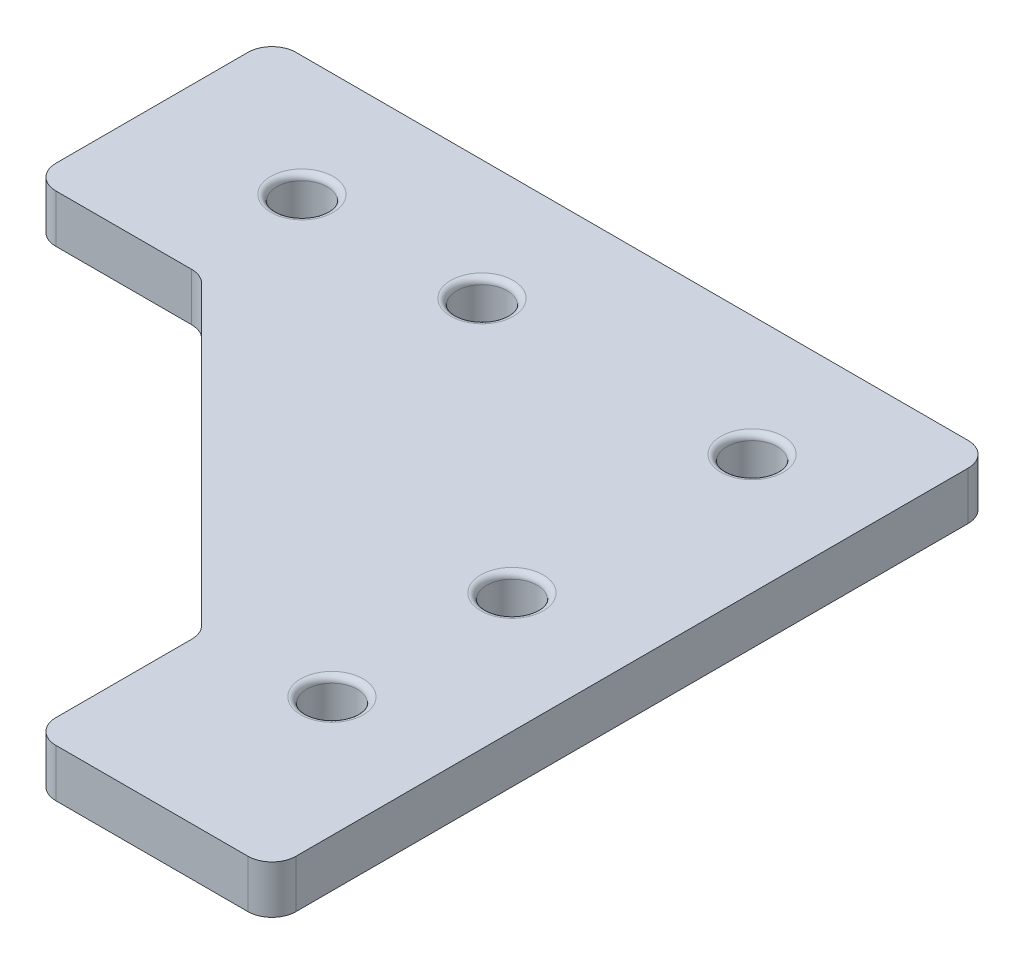
ISO-10303-21;
HEADER;
FILE_DESCRIPTION(('STEP AP214'),'2;1');
FILE_NAME('part.step','',(''),(''),'','','');
FILE_SCHEMA(('AUTOMOTIVE_DESIGN { 1 0 10303 214 1 1 1 1 }'));
ENDSEC;
DATA;
#1=APPLICATION_CONTEXT('core data for automotive mechanical design processes');
#2=APPLICATION_PROTOCOL_DEFINITION('international standard','automotive_design',2000,#1);
#3=PRODUCT_CONTEXT('',#1,'mechanical');
#4=PRODUCT('Part','Part','',(#3));
#5=PRODUCT_RELATED_PRODUCT_CATEGORY('part','',(#4));
#6=PRODUCT_DEFINITION_FORMATION('','',#4);
#7=PRODUCT_DEFINITION_CONTEXT('part definition',#1,'design');
#8=PRODUCT_DEFINITION('design','',#6,#7);
#9=PRODUCT_DEFINITION_SHAPE('','',#8);
#10=(LENGTH_UNIT() NAMED_UNIT(*) SI_UNIT(.MILLI.,.METRE.));
#11=(NAMED_UNIT(*) PLANE_ANGLE_UNIT() SI_UNIT($,.RADIAN.));
#12=(NAMED_UNIT(*) SI_UNIT($,.STERADIAN.) SOLID_ANGLE_UNIT());
#13=UNCERTAINTY_MEASURE_WITH_UNIT(LENGTH_MEASURE(1.E-05),#10,'distance_accuracy_value','');
#14=(GEOMETRIC_REPRESENTATION_CONTEXT(3) GLOBAL_UNCERTAINTY_ASSIGNED_CONTEXT((#13)) GLOBAL_UNIT_ASSIGNED_CONTEXT((#10,
#11,#12)) REPRESENTATION_CONTEXT('',''));
#15=CARTESIAN_POINT('',(0.,0.,0.));
#16=DIRECTION('',(0.,0.,1.));
#17=DIRECTION('',(1.,0.,0.));
#18=AXIS2_PLACEMENT_3D('',#15,#16,#17);
#19=CARTESIAN_POINT('',(410.,-56.,0.));
#20=DIRECTION('',(-1.,0.,0.));
#21=DIRECTION('',(0.,0.,1.));
#22=AXIS2_PLACEMENT_3D('',#19,#20,#21);
#23=PLANE('',#22);
#24=DIRECTION('',(0.,0.,-1.));
#25=VECTOR('',#24,1.);
#26=CARTESIAN_POINT('',(410.,-56.,0.));
#27=LINE('',#26,#25);
#28=CARTESIAN_POINT('',(410.,-56.,1788.));
#29=VERTEX_POINT('',#28);
#30=CARTESIAN_POINT('',(410.,-56.,1732.));
#31=VERTEX_POINT('',#30);
#32=EDGE_CURVE('E164',#29,#31,#27,.T.);
#33=ORIENTED_EDGE('',*,*,#32,.F.);
#34=DIRECTION('',(0.,-1.,0.));
#35=VECTOR('',#34,1.);
#36=CARTESIAN_POINT('',(410.,-56.,1788.));
#37=LINE('',#36,#35);
#38=CARTESIAN_POINT('',(410.,-60.,1788.));
#39=VERTEX_POINT('',#38);
#40=EDGE_CURVE('E148',#29,#39,#37,.T.);
#41=ORIENTED_EDGE('',*,*,#40,.T.);
#42=DIRECTION('',(0.,0.,-1.));
#43=VECTOR('',#42,1.);
#44=CARTESIAN_POINT('',(410.,-60.,0.));
#45=LINE('',#44,#43);
#46=CARTESIAN_POINT('',(410.,-60.,1732.));
#47=VERTEX_POINT('',#46);
#48=EDGE_CURVE('E161',#39,#47,#45,.T.);
#49=ORIENTED_EDGE('',*,*,#48,.T.);
#50=DIRECTION('',(0.,-1.,0.));
#51=VECTOR('',#50,1.);
#52=CARTESIAN_POINT('',(410.,-56.,1732.));
#53=LINE('',#52,#51);
#54=EDGE_CURVE('E167',#47,#31,#53,.F.);
#55=ORIENTED_EDGE('',*,*,#54,.T.);
#56=EDGE_LOOP('',(#33,#41,#49,#55));
#57=FACE_BOUND('',#56,.T.);
#58=ADVANCED_FACE('F40',(#57),#23,.F.);
#59=CARTESIAN_POINT('',(0.,-56.,1730.));
#60=DIRECTION('',(0.,0.,1.));
#61=DIRECTION('',(1.,0.,0.));
#62=AXIS2_PLACEMENT_3D('',#59,#60,#61);
#63=PLANE('',#62);
#64=DIRECTION('',(-1.,0.,0.));
#65=VECTOR('',#64,1.);
#66=CARTESIAN_POINT('',(0.,-60.,1730.));
#67=LINE('',#66,#65);
#68=CARTESIAN_POINT('',(408.,-60.,1730.));
#69=VERTEX_POINT('',#68);
#70=CARTESIAN_POINT('',(352.,-60.,1730.));
#71=VERTEX_POINT('',#70);
#72=EDGE_CURVE('E172',#69,#71,#67,.T.);
#73=ORIENTED_EDGE('',*,*,#72,.T.);
#74=DIRECTION('',(0.,-1.,0.));
#75=VECTOR('',#74,1.);
#76=CARTESIAN_POINT('',(352.,-56.,1730.));
#77=LINE('',#76,#75);
#78=CARTESIAN_POINT('',(352.,-56.,1730.));
#79=VERTEX_POINT('',#78);
#80=EDGE_CURVE('E262',#71,#79,#77,.F.);
#81=ORIENTED_EDGE('',*,*,#80,.T.);
#82=DIRECTION('',(-1.,0.,0.));
#83=VECTOR('',#82,1.);
#84=CARTESIAN_POINT('',(0.,-56.,1730.));
#85=LINE('',#84,#83);
#86=CARTESIAN_POINT('',(408.,-56.,1730.));
#87=VERTEX_POINT('',#86);
#88=EDGE_CURVE('E503',#87,#79,#85,.T.);
#89=ORIENTED_EDGE('',*,*,#88,.F.);
#90=DIRECTION('',(0.,-1.,0.));
#91=VECTOR('',#90,1.);
#92=CARTESIAN_POINT('',(408.,-56.,1730.));
#93=LINE('',#92,#91);
#94=EDGE_CURVE('E258',#87,#69,#93,.T.);
#95=ORIENTED_EDGE('',*,*,#94,.T.);
#96=EDGE_LOOP('',(#73,#81,#89,#95));
#97=FACE_BOUND('',#96,.T.);
#98=ADVANCED_FACE('F363',(#97),#63,.F.);
#99=CARTESIAN_POINT('',(350.,-56.,0.));
#100=DIRECTION('',(1.,0.,0.));
#101=DIRECTION('',(0.,0.,-1.));
#102=AXIS2_PLACEMENT_3D('',#99,#100,#101);
#103=PLANE('',#102);
#104=DIRECTION('',(0.,0.,1.));
#105=VECTOR('',#104,1.);
#106=CARTESIAN_POINT('',(350.,-60.,0.));
#107=LINE('',#106,#105);
#108=CARTESIAN_POINT('',(350.,-60.,1732.));
#109=VERTEX_POINT('',#108);
#110=CARTESIAN_POINT('',(350.,-60.,1748.));
#111=VERTEX_POINT('',#110);
#112=EDGE_CURVE('E176',#109,#111,#107,.T.);
#113=ORIENTED_EDGE('',*,*,#112,.T.);
#114=DIRECTION('',(0.,-1.,0.));
#115=VECTOR('',#114,1.);
#116=CARTESIAN_POINT('',(350.,-56.,1748.));
#117=LINE('',#116,#115);
#118=CARTESIAN_POINT('',(350.,-56.,1748.));
#119=VERTEX_POINT('',#118);
#120=EDGE_CURVE('E255',#111,#119,#117,.F.);
#121=ORIENTED_EDGE('',*,*,#120,.T.);
#122=DIRECTION('',(0.,0.,1.));
#123=VECTOR('',#122,1.);
#124=CARTESIAN_POINT('',(350.,-56.,0.));
#125=LINE('',#124,#123);
#126=CARTESIAN_POINT('',(350.,-56.,1732.));
#127=VERTEX_POINT('',#126);
#128=EDGE_CURVE('E492',#127,#119,#125,.T.);
#129=ORIENTED_EDGE('',*,*,#128,.F.);
#130=DIRECTION('',(0.,-1.,0.));
#131=VECTOR('',#130,1.);
#132=CARTESIAN_POINT('',(350.,-56.,1732.));
#133=LINE('',#132,#131);
#134=EDGE_CURVE('E251',#127,#109,#133,.T.);
#135=ORIENTED_EDGE('',*,*,#134,.T.);
#136=EDGE_LOOP('',(#113,#121,#129,#135));
#137=FACE_BOUND('',#136,.T.);
#138=ADVANCED_FACE('F368',(#137),#103,.F.);
#139=CARTESIAN_POINT('',(0.,-56.,1750.));
#140=DIRECTION('',(0.,0.,-1.));
#141=DIRECTION('',(-1.,0.,0.));
#142=AXIS2_PLACEMENT_3D('',#139,#140,#141);
#143=PLANE('',#142);
#144=DIRECTION('',(1.,0.,0.));
#145=VECTOR('',#144,1.);
#146=CARTESIAN_POINT('',(0.,-56.,1750.));
#147=LINE('',#146,#145);
#148=CARTESIAN_POINT('',(352.,-56.,1750.));
#149=VERTEX_POINT('',#148);
#150=CARTESIAN_POINT('',(363.313708498985,-56.,1750.));
#151=VERTEX_POINT('',#150);
#152=EDGE_CURVE('E490',#149,#151,#147,.T.);
#153=ORIENTED_EDGE('',*,*,#152,.F.);
#154=DIRECTION('',(0.,-1.,0.));
#155=VECTOR('',#154,1.);
#156=CARTESIAN_POINT('',(352.,-56.,1750.));
#157=LINE('',#156,#155);
#158=CARTESIAN_POINT('',(352.,-60.,1750.));
#159=VERTEX_POINT('',#158);
#160=EDGE_CURVE('E247',#149,#159,#157,.T.);
#161=ORIENTED_EDGE('',*,*,#160,.T.);
#162=DIRECTION('',(1.,0.,0.));
#163=VECTOR('',#162,1.);
#164=CARTESIAN_POINT('',(0.,-60.,1750.));
#165=LINE('',#164,#163);
#166=CARTESIAN_POINT('',(363.313708498985,-60.,1750.));
#167=VERTEX_POINT('',#166);
#168=EDGE_CURVE('E185',#159,#167,#165,.T.);
#169=ORIENTED_EDGE('',*,*,#168,.T.);
#170=DIRECTION('',(0.,-1.,0.));
#171=VECTOR('',#170,1.);
#172=CARTESIAN_POINT('',(363.313708498985,-56.,1750.));
#173=LINE('',#172,#171);
#174=EDGE_CURVE('E244',#167,#151,#173,.F.);
#175=ORIENTED_EDGE('',*,*,#174,.T.);
#176=EDGE_LOOP('',(#153,#161,#169,#175));
#177=FACE_BOUND('',#176,.T.);
#178=ADVANCED_FACE('F472',(#177),#143,.F.);
#179=CARTESIAN_POINT('',(-692.928932188136,-56.,692.92893218814));
#180=DIRECTION('',(-0.707106781186545,0.,0.70710678118655));
#181=DIRECTION('',(0.70710678118655,0.,0.707106781186545));
#182=AXIS2_PLACEMENT_3D('',#179,#180,#181);
#183=PLANE('',#182);
#184=DIRECTION('',(-0.70710678118655,0.,-0.707106781186545));
#185=VECTOR('',#184,1.);
#186=CARTESIAN_POINT('',(-692.928932188136,-60.,692.92893218814));
#187=LINE('',#186,#185);
#188=CARTESIAN_POINT('',(389.414213562373,-60.,1775.27207793864));
#189=VERTEX_POINT('',#188);
#190=CARTESIAN_POINT('',(364.727922061358,-60.,1750.58578643763));
#191=VERTEX_POINT('',#190);
#192=EDGE_CURVE('E189',#189,#191,#187,.T.);
#193=ORIENTED_EDGE('',*,*,#192,.F.);
#194=DIRECTION('',(0.,-1.,0.));
#195=VECTOR('',#194,1.);
#196=CARTESIAN_POINT('',(389.414213562373,-56.,1775.27207793864));
#197=LINE('',#196,#195);
#198=CARTESIAN_POINT('',(389.414213562373,-56.,1775.27207793864));
#199=VERTEX_POINT('',#198);
#200=EDGE_CURVE('E241',#189,#199,#197,.F.);
#201=ORIENTED_EDGE('',*,*,#200,.T.);
#202=DIRECTION('',(-0.70710678118655,0.,-0.707106781186545));
#203=VECTOR('',#202,1.);
#204=CARTESIAN_POINT('',(-692.928932188136,-56.,692.92893218814));
#205=LINE('',#204,#203);
#206=CARTESIAN_POINT('',(364.727922061358,-56.,1750.58578643763));
#207=VERTEX_POINT('',#206);
#208=EDGE_CURVE('E496',#199,#207,#205,.T.);
#209=ORIENTED_EDGE('',*,*,#208,.T.);
#210=DIRECTION('',(0.,-1.,0.));
#211=VECTOR('',#210,1.);
#212=CARTESIAN_POINT('',(364.727922061358,-56.,1750.58578643763));
#213=LINE('',#212,#211);
#214=EDGE_CURVE('E237',#207,#191,#213,.T.);
#215=ORIENTED_EDGE('',*,*,#214,.T.);
#216=EDGE_LOOP('',(#193,#201,#209,#215));
#217=FACE_BOUND('',#216,.T.);
#218=ADVANCED_FACE('F469',(#217),#183,.T.);
#219=CARTESIAN_POINT('',(390.,-56.,0.));
#220=DIRECTION('',(1.,0.,0.));
#221=DIRECTION('',(0.,0.,-1.));
#222=AXIS2_PLACEMENT_3D('',#219,#220,#221);
#223=PLANE('',#222);
#224=DIRECTION('',(0.,0.,1.));
#225=VECTOR('',#224,1.);
#226=CARTESIAN_POINT('',(390.,-60.,0.));
#227=LINE('',#226,#225);
#228=CARTESIAN_POINT('',(390.,-60.,1776.68629150102));
#229=VERTEX_POINT('',#228);
#230=CARTESIAN_POINT('',(390.,-60.,1788.));
#231=VERTEX_POINT('',#230);
#232=EDGE_CURVE('E193',#229,#231,#227,.T.);
#233=ORIENTED_EDGE('',*,*,#232,.T.);
#234=DIRECTION('',(0.,-1.,0.));
#235=VECTOR('',#234,1.);
#236=CARTESIAN_POINT('',(390.,-56.,1788.));
#237=LINE('',#236,#235);
#238=CARTESIAN_POINT('',(390.,-56.,1788.));
#239=VERTEX_POINT('',#238);
#240=EDGE_CURVE('E56',#231,#239,#237,.F.);
#241=ORIENTED_EDGE('',*,*,#240,.T.);
#242=DIRECTION('',(0.,0.,1.));
#243=VECTOR('',#242,1.);
#244=CARTESIAN_POINT('',(390.,-56.,0.));
#245=LINE('',#244,#243);
#246=CARTESIAN_POINT('',(390.,-56.,1776.68629150102));
#247=VERTEX_POINT('',#246);
#248=EDGE_CURVE('E501',#247,#239,#245,.T.);
#249=ORIENTED_EDGE('',*,*,#248,.F.);
#250=DIRECTION('',(0.,-1.,0.));
#251=VECTOR('',#250,1.);
#252=CARTESIAN_POINT('',(390.,-56.,1776.68629150102));
#253=LINE('',#252,#251);
#254=EDGE_CURVE('E231',#247,#229,#253,.T.);
#255=ORIENTED_EDGE('',*,*,#254,.T.);
#256=EDGE_LOOP('',(#233,#241,#249,#255));
#257=FACE_BOUND('',#256,.T.);
#258=ADVANCED_FACE('F462',(#257),#223,.F.);
#259=CARTESIAN_POINT('',(362.5,-56.,1740.));
#260=DIRECTION('',(0.,-1.,0.));
#261=DIRECTION('',(0.,0.,-1.));
#262=AXIS2_PLACEMENT_3D('',#259,#260,#261);
#263=CYLINDRICAL_SURFACE('',#262,2.09999999999997);
#264=CARTESIAN_POINT('',(362.5,-59.5,1740.));
#265=DIRECTION('',(0.,1.,0.));
#266=DIRECTION('',(0.,0.,1.));
#267=AXIS2_PLACEMENT_3D('',#264,#265,#266);
#268=CIRCLE('',#267,2.09999999999997);
#269=CARTESIAN_POINT('',(362.5,-59.5,1742.1));
#270=VERTEX_POINT('',#269);
#271=EDGE_CURVE('E11',#270,#270,#268,.F.);
#272=ORIENTED_EDGE('',*,*,#271,.T.);
#273=EDGE_LOOP('',(#272));
#274=FACE_BOUND('',#273,.T.);
#275=CARTESIAN_POINT('',(362.5,-56.5,1740.));
#276=DIRECTION('',(0.,1.,0.));
#277=DIRECTION('',(0.,0.,1.));
#278=AXIS2_PLACEMENT_3D('',#275,#276,#277);
#279=CIRCLE('',#278,2.09999999999997);
#280=CARTESIAN_POINT('',(362.5,-56.5,1742.1));
#281=VERTEX_POINT('',#280);
#282=EDGE_CURVE('E49',#281,#281,#279,.T.);
#283=ORIENTED_EDGE('',*,*,#282,.T.);
#284=EDGE_LOOP('',(#283));
#285=FACE_BOUND('',#284,.T.);
#286=ADVANCED_FACE('F351',(#274,#285),#263,.F.);
#287=CARTESIAN_POINT('',(0.,-56.,1790.));
#288=DIRECTION('',(0.,0.,-1.));
#289=DIRECTION('',(-1.,0.,0.));
#290=AXIS2_PLACEMENT_3D('',#287,#288,#289);
#291=PLANE('',#290);
#292=DIRECTION('',(1.,0.,0.));
#293=VECTOR('',#292,1.);
#294=CARTESIAN_POINT('',(0.,-60.,1790.));
#295=LINE('',#294,#293);
#296=CARTESIAN_POINT('',(392.,-60.,1790.));
#297=VERTEX_POINT('',#296);
#298=CARTESIAN_POINT('',(408.,-60.,1790.));
#299=VERTEX_POINT('',#298);
#300=EDGE_CURVE('E196',#297,#299,#295,.T.);
#301=ORIENTED_EDGE('',*,*,#300,.T.);
#302=DIRECTION('',(0.,-1.,0.));
#303=VECTOR('',#302,1.);
#304=CARTESIAN_POINT('',(408.,-56.,1790.));
#305=LINE('',#304,#303);
#306=CARTESIAN_POINT('',(408.,-56.,1790.));
#307=VERTEX_POINT('',#306);
#308=EDGE_CURVE('E149',#299,#307,#305,.F.);
#309=ORIENTED_EDGE('',*,*,#308,.T.);
#310=DIRECTION('',(1.,0.,0.));
#311=VECTOR('',#310,1.);
#312=CARTESIAN_POINT('',(0.,-56.,1790.));
#313=LINE('',#312,#311);
#314=CARTESIAN_POINT('',(392.,-56.,1790.));
#315=VERTEX_POINT('',#314);
#316=EDGE_CURVE('E179',#315,#307,#313,.T.);
#317=ORIENTED_EDGE('',*,*,#316,.F.);
#318=DIRECTION('',(0.,-1.,0.));
#319=VECTOR('',#318,1.);
#320=CARTESIAN_POINT('',(392.,-56.,1790.));
#321=LINE('',#320,#319);
#322=EDGE_CURVE('E155',#315,#297,#321,.T.);
#323=ORIENTED_EDGE('',*,*,#322,.T.);
#324=EDGE_LOOP('',(#301,#309,#317,#323));
#325=FACE_BOUND('',#324,.T.);
#326=ADVANCED_FACE('F377',(#325),#291,.F.);
#327=CARTESIAN_POINT('',(400.,-56.,1740.));
#328=DIRECTION('',(0.,-1.,0.));
#329=DIRECTION('',(0.,0.,-1.));
#330=AXIS2_PLACEMENT_3D('',#327,#328,#329);
#331=CYLINDRICAL_SURFACE('',#330,2.09999999999997);
#332=CARTESIAN_POINT('',(400.,-59.5,1740.));
#333=DIRECTION('',(0.,1.,0.));
#334=DIRECTION('',(0.,0.,1.));
#335=AXIS2_PLACEMENT_3D('',#332,#333,#334);
#336=CIRCLE('',#335,2.09999999999997);
#337=CARTESIAN_POINT('',(400.,-59.5,1742.1));
#338=VERTEX_POINT('',#337);
#339=EDGE_CURVE('E336',#338,#338,#336,.F.);
#340=ORIENTED_EDGE('',*,*,#339,.T.);
#341=EDGE_LOOP('',(#340));
#342=FACE_BOUND('',#341,.T.);
#343=CARTESIAN_POINT('',(400.,-56.5,1740.));
#344=DIRECTION('',(0.,1.,0.));
#345=DIRECTION('',(0.,0.,1.));
#346=AXIS2_PLACEMENT_3D('',#343,#344,#345);
#347=CIRCLE('',#346,2.09999999999997);
#348=CARTESIAN_POINT('',(400.,-56.5,1742.1));
#349=VERTEX_POINT('',#348);
#350=EDGE_CURVE('E332',#349,#349,#347,.T.);
#351=ORIENTED_EDGE('',*,*,#350,.T.);
#352=EDGE_LOOP('',(#351));
#353=FACE_BOUND('',#352,.T.);
#354=ADVANCED_FACE('F373',(#342,#353),#331,.F.);
#355=CARTESIAN_POINT('',(400.,-56.,1760.));
#356=DIRECTION('',(0.,-1.,0.));
#357=DIRECTION('',(0.,0.,-1.));
#358=AXIS2_PLACEMENT_3D('',#355,#356,#357);
#359=CYLINDRICAL_SURFACE('',#358,2.09999999999997);
#360=CARTESIAN_POINT('',(400.,-59.5,1760.));
#361=DIRECTION('',(0.,1.,0.));
#362=DIRECTION('',(0.,0.,1.));
#363=AXIS2_PLACEMENT_3D('',#360,#361,#362);
#364=CIRCLE('',#363,2.09999999999997);
#365=CARTESIAN_POINT('',(400.,-59.5,1762.1));
#366=VERTEX_POINT('',#365);
#367=EDGE_CURVE('E328',#366,#366,#364,.F.);
#368=ORIENTED_EDGE('',*,*,#367,.T.);
#369=EDGE_LOOP('',(#368));
#370=FACE_BOUND('',#369,.T.);
#371=CARTESIAN_POINT('',(400.,-56.5,1760.));
#372=DIRECTION('',(0.,1.,0.));
#373=DIRECTION('',(0.,0.,1.));
#374=AXIS2_PLACEMENT_3D('',#371,#372,#373);
#375=CIRCLE('',#374,2.09999999999997);
#376=CARTESIAN_POINT('',(400.,-56.5,1762.1));
#377=VERTEX_POINT('',#376);
#378=EDGE_CURVE('E324',#377,#377,#375,.T.);
#379=ORIENTED_EDGE('',*,*,#378,.T.);
#380=EDGE_LOOP('',(#379));
#381=FACE_BOUND('',#380,.T.);
#382=ADVANCED_FACE('F376',(#370,#381),#359,.F.);
#383=CARTESIAN_POINT('',(400.,-56.,1775.));
#384=DIRECTION('',(0.,-1.,0.));
#385=DIRECTION('',(0.,0.,-1.));
#386=AXIS2_PLACEMENT_3D('',#383,#384,#385);
#387=CYLINDRICAL_SURFACE('',#386,2.09999999999997);
#388=CARTESIAN_POINT('',(400.,-59.5,1775.));
#389=DIRECTION('',(0.,1.,0.));
#390=DIRECTION('',(0.,0.,1.));
#391=AXIS2_PLACEMENT_3D('',#388,#389,#390);
#392=CIRCLE('',#391,2.09999999999997);
#393=CARTESIAN_POINT('',(400.,-59.5,1777.1));
#394=VERTEX_POINT('',#393);
#395=EDGE_CURVE('E300',#394,#394,#392,.F.);
#396=ORIENTED_EDGE('',*,*,#395,.T.);
#397=EDGE_LOOP('',(#396));
#398=FACE_BOUND('',#397,.T.);
#399=CARTESIAN_POINT('',(400.,-56.5,1775.));
#400=DIRECTION('',(0.,1.,0.));
#401=DIRECTION('',(0.,0.,1.));
#402=AXIS2_PLACEMENT_3D('',#399,#400,#401);
#403=CIRCLE('',#402,2.09999999999997);
#404=CARTESIAN_POINT('',(400.,-56.5,1777.1));
#405=VERTEX_POINT('',#404);
#406=EDGE_CURVE('E296',#405,#405,#403,.T.);
#407=ORIENTED_EDGE('',*,*,#406,.T.);
#408=EDGE_LOOP('',(#407));
#409=FACE_BOUND('',#408,.T.);
#410=ADVANCED_FACE('F381',(#398,#409),#387,.F.);
#411=CARTESIAN_POINT('',(377.5,-56.,1740.));
#412=DIRECTION('',(0.,-1.,0.));
#413=DIRECTION('',(0.,0.,-1.));
#414=AXIS2_PLACEMENT_3D('',#411,#412,#413);
#415=CYLINDRICAL_SURFACE('',#414,2.09999999999997);
#416=CARTESIAN_POINT('',(377.5,-59.5,1740.));
#417=DIRECTION('',(0.,1.,0.));
#418=DIRECTION('',(0.,0.,1.));
#419=AXIS2_PLACEMENT_3D('',#416,#417,#418);
#420=CIRCLE('',#419,2.09999999999997);
#421=CARTESIAN_POINT('',(377.5,-59.5,1742.1));
#422=VERTEX_POINT('',#421);
#423=EDGE_CURVE('E344',#422,#422,#420,.F.);
#424=ORIENTED_EDGE('',*,*,#423,.T.);
#425=EDGE_LOOP('',(#424));
#426=FACE_BOUND('',#425,.T.);
#427=CARTESIAN_POINT('',(377.5,-56.5,1740.));
#428=DIRECTION('',(0.,1.,0.));
#429=DIRECTION('',(0.,0.,1.));
#430=AXIS2_PLACEMENT_3D('',#427,#428,#429);
#431=CIRCLE('',#430,2.09999999999997);
#432=CARTESIAN_POINT('',(377.5,-56.5,1742.1));
#433=VERTEX_POINT('',#432);
#434=EDGE_CURVE('E340',#433,#433,#431,.T.);
#435=ORIENTED_EDGE('',*,*,#434,.T.);
#436=EDGE_LOOP('',(#435));
#437=FACE_BOUND('',#436,.T.);
#438=ADVANCED_FACE('F385',(#426,#437),#415,.F.);
#439=CARTESIAN_POINT('',(0.,-56.,0.));
#440=DIRECTION('',(0.,1.,0.));
#441=DIRECTION('',(0.,0.,1.));
#442=AXIS2_PLACEMENT_3D('',#439,#440,#441);
#443=PLANE('',#442);
#444=CARTESIAN_POINT('',(400.,-56.,1775.));
#445=DIRECTION('',(0.,1.,0.));
#446=DIRECTION('',(0.,0.,1.));
#447=AXIS2_PLACEMENT_3D('',#444,#445,#446);
#448=CIRCLE('',#447,2.59999999999997);
#449=CARTESIAN_POINT('',(400.,-56.,1777.6));
#450=VERTEX_POINT('',#449);
#451=EDGE_CURVE('E320',#450,#450,#448,.F.);
#452=ORIENTED_EDGE('',*,*,#451,.T.);
#453=EDGE_LOOP('',(#452));
#454=FACE_BOUND('',#453,.T.);
#455=CARTESIAN_POINT('',(400.,-56.,1760.));
#456=DIRECTION('',(0.,1.,0.));
#457=DIRECTION('',(0.,0.,1.));
#458=AXIS2_PLACEMENT_3D('',#455,#456,#457);
#459=CIRCLE('',#458,2.59999999999997);
#460=CARTESIAN_POINT('',(400.,-56.,1762.6));
#461=VERTEX_POINT('',#460);
#462=EDGE_CURVE('E316',#461,#461,#459,.F.);
#463=ORIENTED_EDGE('',*,*,#462,.T.);
#464=EDGE_LOOP('',(#463));
#465=FACE_BOUND('',#464,.T.);
#466=CARTESIAN_POINT('',(400.,-56.,1740.));
#467=DIRECTION('',(0.,1.,0.));
#468=DIRECTION('',(0.,0.,1.));
#469=AXIS2_PLACEMENT_3D('',#466,#467,#468);
#470=CIRCLE('',#469,2.59999999999997);
#471=CARTESIAN_POINT('',(400.,-56.,1742.6));
#472=VERTEX_POINT('',#471);
#473=EDGE_CURVE('E312',#472,#472,#470,.F.);
#474=ORIENTED_EDGE('',*,*,#473,.T.);
#475=EDGE_LOOP('',(#474));
#476=FACE_BOUND('',#475,.T.);
#477=CARTESIAN_POINT('',(377.5,-56.,1740.));
#478=DIRECTION('',(0.,1.,0.));
#479=DIRECTION('',(0.,0.,1.));
#480=AXIS2_PLACEMENT_3D('',#477,#478,#479);
#481=CIRCLE('',#480,2.59999999999997);
#482=CARTESIAN_POINT('',(377.5,-56.,1742.6));
#483=VERTEX_POINT('',#482);
#484=EDGE_CURVE('E308',#483,#483,#481,.F.);
#485=ORIENTED_EDGE('',*,*,#484,.T.);
#486=EDGE_LOOP('',(#485));
#487=FACE_BOUND('',#486,.T.);
#488=CARTESIAN_POINT('',(362.5,-56.,1740.));
#489=DIRECTION('',(0.,1.,0.));
#490=DIRECTION('',(0.,0.,1.));
#491=AXIS2_PLACEMENT_3D('',#488,#489,#490);
#492=CIRCLE('',#491,2.59999999999997);
#493=CARTESIAN_POINT('',(362.5,-56.,1742.6));
#494=VERTEX_POINT('',#493);
#495=EDGE_CURVE('E304',#494,#494,#492,.F.);
#496=ORIENTED_EDGE('',*,*,#495,.T.);
#497=EDGE_LOOP('',(#496));
#498=FACE_BOUND('',#497,.T.);
#499=ORIENTED_EDGE('',*,*,#316,.T.);
#500=CARTESIAN_POINT('',(408.,-56.,1788.));
#501=DIRECTION('',(0.,1.,0.));
#502=DIRECTION('',(0.,0.,1.));
#503=AXIS2_PLACEMENT_3D('',#500,#501,#502);
#504=CIRCLE('',#503,2.);
#505=EDGE_CURVE('E228',#307,#29,#504,.T.);
#506=ORIENTED_EDGE('',*,*,#505,.T.);
#507=ORIENTED_EDGE('',*,*,#32,.T.);
#508=CARTESIAN_POINT('',(408.,-56.,1732.));
#509=DIRECTION('',(0.,1.,0.));
#510=DIRECTION('',(0.,0.,1.));
#511=AXIS2_PLACEMENT_3D('',#508,#509,#510);
#512=CIRCLE('',#511,2.);
#513=EDGE_CURVE('E216',#31,#87,#512,.T.);
#514=ORIENTED_EDGE('',*,*,#513,.T.);
#515=ORIENTED_EDGE('',*,*,#88,.T.);
#516=CARTESIAN_POINT('',(352.,-56.,1732.));
#517=DIRECTION('',(0.,1.,0.));
#518=DIRECTION('',(0.,0.,1.));
#519=AXIS2_PLACEMENT_3D('',#516,#517,#518);
#520=CIRCLE('',#519,2.);
#521=EDGE_CURVE('E219',#79,#127,#520,.T.);
#522=ORIENTED_EDGE('',*,*,#521,.T.);
#523=ORIENTED_EDGE('',*,*,#128,.T.);
#524=CARTESIAN_POINT('',(352.,-56.,1748.));
#525=DIRECTION('',(0.,1.,0.));
#526=DIRECTION('',(0.,0.,1.));
#527=AXIS2_PLACEMENT_3D('',#524,#525,#526);
#528=CIRCLE('',#527,2.);
#529=EDGE_CURVE('E222',#119,#149,#528,.T.);
#530=ORIENTED_EDGE('',*,*,#529,.T.);
#531=ORIENTED_EDGE('',*,*,#152,.T.);
#532=CARTESIAN_POINT('',(363.313708498985,-56.,1752.));
#533=DIRECTION('',(0.,1.,0.));
#534=DIRECTION('',(0.,0.,1.));
#535=AXIS2_PLACEMENT_3D('',#532,#533,#534);
#536=CIRCLE('',#535,2.);
#537=EDGE_CURVE('E273',#151,#207,#536,.F.);
#538=ORIENTED_EDGE('',*,*,#537,.T.);
#539=ORIENTED_EDGE('',*,*,#208,.F.);
#540=CARTESIAN_POINT('',(388.,-56.,1776.68629150102));
#541=DIRECTION('',(0.,1.,0.));
#542=DIRECTION('',(0.,0.,1.));
#543=AXIS2_PLACEMENT_3D('',#540,#541,#542);
#544=CIRCLE('',#543,2.);
#545=EDGE_CURVE('E63',#199,#247,#544,.F.);
#546=ORIENTED_EDGE('',*,*,#545,.T.);
#547=ORIENTED_EDGE('',*,*,#248,.T.);
#548=CARTESIAN_POINT('',(392.,-56.,1788.));
#549=DIRECTION('',(0.,1.,0.));
#550=DIRECTION('',(0.,0.,1.));
#551=AXIS2_PLACEMENT_3D('',#548,#549,#550);
#552=CIRCLE('',#551,2.);
#553=EDGE_CURVE('E225',#239,#315,#552,.T.);
#554=ORIENTED_EDGE('',*,*,#553,.T.);
#555=EDGE_LOOP('',(#499,#506,#507,#514,#515,#522,#523,#530,#531,#538,#539,#546,#547,#554));
#556=FACE_BOUND('',#555,.T.);
#557=ADVANCED_FACE('F450',(#454,#465,#476,#487,#498,#556),#443,.T.);
#558=CARTESIAN_POINT('',(0.,-60.,0.));
#559=DIRECTION('',(0.,1.,0.));
#560=DIRECTION('',(0.,0.,1.));
#561=AXIS2_PLACEMENT_3D('',#558,#559,#560);
#562=PLANE('',#561);
#563=CARTESIAN_POINT('',(400.,-60.,1775.));
#564=DIRECTION('',(0.,1.,0.));
#565=DIRECTION('',(0.,0.,1.));
#566=AXIS2_PLACEMENT_3D('',#563,#564,#565);
#567=CIRCLE('',#566,2.59999999999997);
#568=CARTESIAN_POINT('',(400.,-60.,1777.6));
#569=VERTEX_POINT('',#568);
#570=EDGE_CURVE('E292',#569,#569,#567,.T.);
#571=ORIENTED_EDGE('',*,*,#570,.T.);
#572=EDGE_LOOP('',(#571));
#573=FACE_BOUND('',#572,.T.);
#574=CARTESIAN_POINT('',(400.,-60.,1760.));
#575=DIRECTION('',(0.,1.,0.));
#576=DIRECTION('',(0.,0.,1.));
#577=AXIS2_PLACEMENT_3D('',#574,#575,#576);
#578=CIRCLE('',#577,2.59999999999997);
#579=CARTESIAN_POINT('',(400.,-60.,1762.6));
#580=VERTEX_POINT('',#579);
#581=EDGE_CURVE('E288',#580,#580,#578,.T.);
#582=ORIENTED_EDGE('',*,*,#581,.T.);
#583=EDGE_LOOP('',(#582));
#584=FACE_BOUND('',#583,.T.);
#585=CARTESIAN_POINT('',(400.,-60.,1740.));
#586=DIRECTION('',(0.,1.,0.));
#587=DIRECTION('',(0.,0.,1.));
#588=AXIS2_PLACEMENT_3D('',#585,#586,#587);
#589=CIRCLE('',#588,2.59999999999997);
#590=CARTESIAN_POINT('',(400.,-60.,1742.6));
#591=VERTEX_POINT('',#590);
#592=EDGE_CURVE('E284',#591,#591,#589,.T.);
#593=ORIENTED_EDGE('',*,*,#592,.T.);
#594=EDGE_LOOP('',(#593));
#595=FACE_BOUND('',#594,.T.);
#596=CARTESIAN_POINT('',(377.5,-60.,1740.));
#597=DIRECTION('',(0.,1.,0.));
#598=DIRECTION('',(0.,0.,1.));
#599=AXIS2_PLACEMENT_3D('',#596,#597,#598);
#600=CIRCLE('',#599,2.59999999999997);
#601=CARTESIAN_POINT('',(377.5,-60.,1742.6));
#602=VERTEX_POINT('',#601);
#603=EDGE_CURVE('E280',#602,#602,#600,.T.);
#604=ORIENTED_EDGE('',*,*,#603,.T.);
#605=EDGE_LOOP('',(#604));
#606=FACE_BOUND('',#605,.T.);
#607=CARTESIAN_POINT('',(362.5,-60.,1740.));
#608=DIRECTION('',(0.,1.,0.));
#609=DIRECTION('',(0.,0.,1.));
#610=AXIS2_PLACEMENT_3D('',#607,#608,#609);
#611=CIRCLE('',#610,2.59999999999997);
#612=CARTESIAN_POINT('',(362.5,-60.,1742.6));
#613=VERTEX_POINT('',#612);
#614=EDGE_CURVE('E276',#613,#613,#611,.T.);
#615=ORIENTED_EDGE('',*,*,#614,.T.);
#616=EDGE_LOOP('',(#615));
#617=FACE_BOUND('',#616,.T.);
#618=ORIENTED_EDGE('',*,*,#48,.F.);
#619=CARTESIAN_POINT('',(408.,-60.,1788.));
#620=DIRECTION('',(0.,1.,0.));
#621=DIRECTION('',(0.,0.,1.));
#622=AXIS2_PLACEMENT_3D('',#619,#620,#621);
#623=CIRCLE('',#622,2.);
#624=EDGE_CURVE('E144',#39,#299,#623,.F.);
#625=ORIENTED_EDGE('',*,*,#624,.T.);
#626=ORIENTED_EDGE('',*,*,#300,.F.);
#627=CARTESIAN_POINT('',(392.,-60.,1788.));
#628=DIRECTION('',(0.,1.,0.));
#629=DIRECTION('',(0.,0.,1.));
#630=AXIS2_PLACEMENT_3D('',#627,#628,#629);
#631=CIRCLE('',#630,2.);
#632=EDGE_CURVE('E156',#297,#231,#631,.F.);
#633=ORIENTED_EDGE('',*,*,#632,.T.);
#634=ORIENTED_EDGE('',*,*,#232,.F.);
#635=CARTESIAN_POINT('',(388.,-60.,1776.68629150102));
#636=DIRECTION('',(0.,1.,0.));
#637=DIRECTION('',(0.,0.,1.));
#638=AXIS2_PLACEMENT_3D('',#635,#636,#637);
#639=CIRCLE('',#638,2.);
#640=EDGE_CURVE('E265',#229,#189,#639,.T.);
#641=ORIENTED_EDGE('',*,*,#640,.T.);
#642=ORIENTED_EDGE('',*,*,#192,.T.);
#643=CARTESIAN_POINT('',(363.313708498985,-60.,1752.));
#644=DIRECTION('',(0.,1.,0.));
#645=DIRECTION('',(0.,0.,1.));
#646=AXIS2_PLACEMENT_3D('',#643,#644,#645);
#647=CIRCLE('',#646,2.);
#648=EDGE_CURVE('E270',#191,#167,#647,.T.);
#649=ORIENTED_EDGE('',*,*,#648,.T.);
#650=ORIENTED_EDGE('',*,*,#168,.F.);
#651=CARTESIAN_POINT('',(352.,-60.,1748.));
#652=DIRECTION('',(0.,1.,0.));
#653=DIRECTION('',(0.,0.,1.));
#654=AXIS2_PLACEMENT_3D('',#651,#652,#653);
#655=CIRCLE('',#654,2.);
#656=EDGE_CURVE('E206',#159,#111,#655,.F.);
#657=ORIENTED_EDGE('',*,*,#656,.T.);
#658=ORIENTED_EDGE('',*,*,#112,.F.);
#659=CARTESIAN_POINT('',(352.,-60.,1732.));
#660=DIRECTION('',(0.,1.,0.));
#661=DIRECTION('',(0.,0.,1.));
#662=AXIS2_PLACEMENT_3D('',#659,#660,#661);
#663=CIRCLE('',#662,2.);
#664=EDGE_CURVE('E203',#109,#71,#663,.F.);
#665=ORIENTED_EDGE('',*,*,#664,.T.);
#666=ORIENTED_EDGE('',*,*,#72,.F.);
#667=CARTESIAN_POINT('',(408.,-60.,1732.));
#668=DIRECTION('',(0.,1.,0.));
#669=DIRECTION('',(0.,0.,1.));
#670=AXIS2_PLACEMENT_3D('',#667,#668,#669);
#671=CIRCLE('',#670,2.);
#672=EDGE_CURVE('E166',#69,#47,#671,.F.);
#673=ORIENTED_EDGE('',*,*,#672,.T.);
#674=EDGE_LOOP('',(#618,#625,#626,#633,#634,#641,#642,#649,#650,#657,#658,#665,#666,#673));
#675=FACE_BOUND('',#674,.T.);
#676=ADVANCED_FACE('F169',(#573,#584,#595,#606,#617,#675),#562,.F.);
#677=CARTESIAN_POINT('',(408.,-56.,1788.));
#678=DIRECTION('',(0.,-1.,0.));
#679=DIRECTION('',(0.,0.,-1.));
#680=AXIS2_PLACEMENT_3D('',#677,#678,#679);
#681=CYLINDRICAL_SURFACE('',#680,2.);
#682=ORIENTED_EDGE('',*,*,#505,.F.);
#683=ORIENTED_EDGE('',*,*,#308,.F.);
#684=ORIENTED_EDGE('',*,*,#624,.F.);
#685=ORIENTED_EDGE('',*,*,#40,.F.);
#686=EDGE_LOOP('',(#682,#683,#684,#685));
#687=FACE_BOUND('',#686,.T.);
#688=ADVANCED_FACE('F147',(#687),#681,.T.);
#689=CARTESIAN_POINT('',(392.,-56.,1788.));
#690=DIRECTION('',(0.,-1.,0.));
#691=DIRECTION('',(0.,0.,-1.));
#692=AXIS2_PLACEMENT_3D('',#689,#690,#691);
#693=CYLINDRICAL_SURFACE('',#692,2.);
#694=ORIENTED_EDGE('',*,*,#553,.F.);
#695=ORIENTED_EDGE('',*,*,#240,.F.);
#696=ORIENTED_EDGE('',*,*,#632,.F.);
#697=ORIENTED_EDGE('',*,*,#322,.F.);
#698=EDGE_LOOP('',(#694,#695,#696,#697));
#699=FACE_BOUND('',#698,.T.);
#700=ADVANCED_FACE('F389',(#699),#693,.T.);
#701=CARTESIAN_POINT('',(388.,-56.,1776.68629150102));
#702=DIRECTION('',(0.,-1.,0.));
#703=DIRECTION('',(0.,0.,-1.));
#704=AXIS2_PLACEMENT_3D('',#701,#702,#703);
#705=CYLINDRICAL_SURFACE('',#704,2.);
#706=ORIENTED_EDGE('',*,*,#545,.F.);
#707=ORIENTED_EDGE('',*,*,#200,.F.);
#708=ORIENTED_EDGE('',*,*,#640,.F.);
#709=ORIENTED_EDGE('',*,*,#254,.F.);
#710=EDGE_LOOP('',(#706,#707,#708,#709));
#711=FACE_BOUND('',#710,.T.);
#712=ADVANCED_FACE('F392',(#711),#705,.F.);
#713=CARTESIAN_POINT('',(352.,-56.,1748.));
#714=DIRECTION('',(0.,-1.,0.));
#715=DIRECTION('',(0.,0.,-1.));
#716=AXIS2_PLACEMENT_3D('',#713,#714,#715);
#717=CYLINDRICAL_SURFACE('',#716,2.);
#718=ORIENTED_EDGE('',*,*,#529,.F.);
#719=ORIENTED_EDGE('',*,*,#120,.F.);
#720=ORIENTED_EDGE('',*,*,#656,.F.);
#721=ORIENTED_EDGE('',*,*,#160,.F.);
#722=EDGE_LOOP('',(#718,#719,#720,#721));
#723=FACE_BOUND('',#722,.T.);
#724=ADVANCED_FACE('F396',(#723),#717,.T.);
#725=CARTESIAN_POINT('',(352.,-56.,1732.));
#726=DIRECTION('',(0.,-1.,0.));
#727=DIRECTION('',(0.,0.,-1.));
#728=AXIS2_PLACEMENT_3D('',#725,#726,#727);
#729=CYLINDRICAL_SURFACE('',#728,2.);
#730=ORIENTED_EDGE('',*,*,#521,.F.);
#731=ORIENTED_EDGE('',*,*,#80,.F.);
#732=ORIENTED_EDGE('',*,*,#664,.F.);
#733=ORIENTED_EDGE('',*,*,#134,.F.);
#734=EDGE_LOOP('',(#730,#731,#732,#733));
#735=FACE_BOUND('',#734,.T.);
#736=ADVANCED_FACE('F400',(#735),#729,.T.);
#737=CARTESIAN_POINT('',(408.,-56.,1732.));
#738=DIRECTION('',(0.,-1.,0.));
#739=DIRECTION('',(0.,0.,-1.));
#740=AXIS2_PLACEMENT_3D('',#737,#738,#739);
#741=CYLINDRICAL_SURFACE('',#740,2.);
#742=ORIENTED_EDGE('',*,*,#513,.F.);
#743=ORIENTED_EDGE('',*,*,#54,.F.);
#744=ORIENTED_EDGE('',*,*,#672,.F.);
#745=ORIENTED_EDGE('',*,*,#94,.F.);
#746=EDGE_LOOP('',(#742,#743,#744,#745));
#747=FACE_BOUND('',#746,.T.);
#748=ADVANCED_FACE('F404',(#747),#741,.T.);
#749=CARTESIAN_POINT('',(363.313708498985,-56.,1752.));
#750=DIRECTION('',(0.,-1.,0.));
#751=DIRECTION('',(0.,0.,-1.));
#752=AXIS2_PLACEMENT_3D('',#749,#750,#751);
#753=CYLINDRICAL_SURFACE('',#752,2.);
#754=ORIENTED_EDGE('',*,*,#537,.F.);
#755=ORIENTED_EDGE('',*,*,#174,.F.);
#756=ORIENTED_EDGE('',*,*,#648,.F.);
#757=ORIENTED_EDGE('',*,*,#214,.F.);
#758=EDGE_LOOP('',(#754,#755,#756,#757));
#759=FACE_BOUND('',#758,.T.);
#760=ADVANCED_FACE('F408',(#759),#753,.F.);
#761=CARTESIAN_POINT('',(400.,-59.5,1775.));
#762=DIRECTION('',(0.,1.,0.));
#763=DIRECTION('',(0.,0.,1.));
#764=AXIS2_PLACEMENT_3D('',#761,#762,#763);
#765=TOROIDAL_SURFACE('',#764,2.59999999999997,0.5);
#766=ORIENTED_EDGE('',*,*,#395,.F.);
#767=EDGE_LOOP('',(#766));
#768=FACE_BOUND('',#767,.T.);
#769=ORIENTED_EDGE('',*,*,#570,.F.);
#770=EDGE_LOOP('',(#769));
#771=FACE_BOUND('',#770,.T.);
#772=ADVANCED_FACE('F412',(#768,#771),#765,.T.);
#773=CARTESIAN_POINT('',(400.,-56.5,1775.));
#774=DIRECTION('',(0.,1.,0.));
#775=DIRECTION('',(0.,0.,1.));
#776=AXIS2_PLACEMENT_3D('',#773,#774,#775);
#777=TOROIDAL_SURFACE('',#776,2.59999999999997,0.5);
#778=ORIENTED_EDGE('',*,*,#451,.F.);
#779=EDGE_LOOP('',(#778));
#780=FACE_BOUND('',#779,.T.);
#781=ORIENTED_EDGE('',*,*,#406,.F.);
#782=EDGE_LOOP('',(#781));
#783=FACE_BOUND('',#782,.T.);
#784=ADVANCED_FACE('F416',(#780,#783),#777,.T.);
#785=CARTESIAN_POINT('',(400.,-59.5,1760.));
#786=DIRECTION('',(0.,1.,0.));
#787=DIRECTION('',(0.,0.,1.));
#788=AXIS2_PLACEMENT_3D('',#785,#786,#787);
#789=TOROIDAL_SURFACE('',#788,2.59999999999997,0.5);
#790=ORIENTED_EDGE('',*,*,#367,.F.);
#791=EDGE_LOOP('',(#790));
#792=FACE_BOUND('',#791,.T.);
#793=ORIENTED_EDGE('',*,*,#581,.F.);
#794=EDGE_LOOP('',(#793));
#795=FACE_BOUND('',#794,.T.);
#796=ADVANCED_FACE('F420',(#792,#795),#789,.T.);
#797=CARTESIAN_POINT('',(400.,-56.5,1760.));
#798=DIRECTION('',(0.,1.,0.));
#799=DIRECTION('',(0.,0.,1.));
#800=AXIS2_PLACEMENT_3D('',#797,#798,#799);
#801=TOROIDAL_SURFACE('',#800,2.59999999999997,0.5);
#802=ORIENTED_EDGE('',*,*,#462,.F.);
#803=EDGE_LOOP('',(#802));
#804=FACE_BOUND('',#803,.T.);
#805=ORIENTED_EDGE('',*,*,#378,.F.);
#806=EDGE_LOOP('',(#805));
#807=FACE_BOUND('',#806,.T.);
#808=ADVANCED_FACE('F424',(#804,#807),#801,.T.);
#809=CARTESIAN_POINT('',(400.,-59.5,1740.));
#810=DIRECTION('',(0.,1.,0.));
#811=DIRECTION('',(0.,0.,1.));
#812=AXIS2_PLACEMENT_3D('',#809,#810,#811);
#813=TOROIDAL_SURFACE('',#812,2.59999999999997,0.5);
#814=ORIENTED_EDGE('',*,*,#339,.F.);
#815=EDGE_LOOP('',(#814));
#816=FACE_BOUND('',#815,.T.);
#817=ORIENTED_EDGE('',*,*,#592,.F.);
#818=EDGE_LOOP('',(#817));
#819=FACE_BOUND('',#818,.T.);
#820=ADVANCED_FACE('F428',(#816,#819),#813,.T.);
#821=CARTESIAN_POINT('',(400.,-56.5,1740.));
#822=DIRECTION('',(0.,1.,0.));
#823=DIRECTION('',(0.,0.,1.));
#824=AXIS2_PLACEMENT_3D('',#821,#822,#823);
#825=TOROIDAL_SURFACE('',#824,2.59999999999997,0.5);
#826=ORIENTED_EDGE('',*,*,#473,.F.);
#827=EDGE_LOOP('',(#826));
#828=FACE_BOUND('',#827,.T.);
#829=ORIENTED_EDGE('',*,*,#350,.F.);
#830=EDGE_LOOP('',(#829));
#831=FACE_BOUND('',#830,.T.);
#832=ADVANCED_FACE('F432',(#828,#831),#825,.T.);
#833=CARTESIAN_POINT('',(377.5,-59.5,1740.));
#834=DIRECTION('',(0.,1.,0.));
#835=DIRECTION('',(0.,0.,1.));
#836=AXIS2_PLACEMENT_3D('',#833,#834,#835);
#837=TOROIDAL_SURFACE('',#836,2.59999999999997,0.5);
#838=ORIENTED_EDGE('',*,*,#423,.F.);
#839=EDGE_LOOP('',(#838));
#840=FACE_BOUND('',#839,.T.);
#841=ORIENTED_EDGE('',*,*,#603,.F.);
#842=EDGE_LOOP('',(#841));
#843=FACE_BOUND('',#842,.T.);
#844=ADVANCED_FACE('F436',(#840,#843),#837,.T.);
#845=CARTESIAN_POINT('',(377.5,-56.5,1740.));
#846=DIRECTION('',(0.,1.,0.));
#847=DIRECTION('',(0.,0.,1.));
#848=AXIS2_PLACEMENT_3D('',#845,#846,#847);
#849=TOROIDAL_SURFACE('',#848,2.59999999999997,0.5);
#850=ORIENTED_EDGE('',*,*,#484,.F.);
#851=EDGE_LOOP('',(#850));
#852=FACE_BOUND('',#851,.T.);
#853=ORIENTED_EDGE('',*,*,#434,.F.);
#854=EDGE_LOOP('',(#853));
#855=FACE_BOUND('',#854,.T.);
#856=ADVANCED_FACE('F359',(#852,#855),#849,.T.);
#857=CARTESIAN_POINT('',(362.5,-59.5,1740.));
#858=DIRECTION('',(0.,1.,0.));
#859=DIRECTION('',(0.,0.,1.));
#860=AXIS2_PLACEMENT_3D('',#857,#858,#859);
#861=TOROIDAL_SURFACE('',#860,2.59999999999997,0.5);
#862=ORIENTED_EDGE('',*,*,#271,.F.);
#863=EDGE_LOOP('',(#862));
#864=FACE_BOUND('',#863,.T.);
#865=ORIENTED_EDGE('',*,*,#614,.F.);
#866=EDGE_LOOP('',(#865));
#867=FACE_BOUND('',#866,.T.);
#868=ADVANCED_FACE('F354',(#864,#867),#861,.T.);
#869=CARTESIAN_POINT('',(362.5,-56.5,1740.));
#870=DIRECTION('',(0.,1.,0.));
#871=DIRECTION('',(0.,0.,1.));
#872=AXIS2_PLACEMENT_3D('',#869,#870,#871);
#873=TOROIDAL_SURFACE('',#872,2.59999999999997,0.5);
#874=ORIENTED_EDGE('',*,*,#495,.F.);
#875=EDGE_LOOP('',(#874));
#876=FACE_BOUND('',#875,.T.);
#877=ORIENTED_EDGE('',*,*,#282,.F.);
#878=EDGE_LOOP('',(#877));
#879=FACE_BOUND('',#878,.T.);
#880=ADVANCED_FACE('F42',(#876,#879),#873,.T.);
#881=CLOSED_SHELL('',(#58,#98,#138,#178,#218,#258,#286,#326,#354,#382,#410,#438,#557,#676,#688,
#700,#712,#724,#736,#748,#760,#772,#784,#796,#808,#820,#832,#844,#856,#868,#880));
#882=MANIFOLD_SOLID_BREP('B2',#881);
#883=ADVANCED_BREP_SHAPE_REPRESENTATION('',(#18,#882),#14);
#884=SHAPE_DEFINITION_REPRESENTATION(#9,#883);
ENDSEC;
END-ISO-10303-21;
